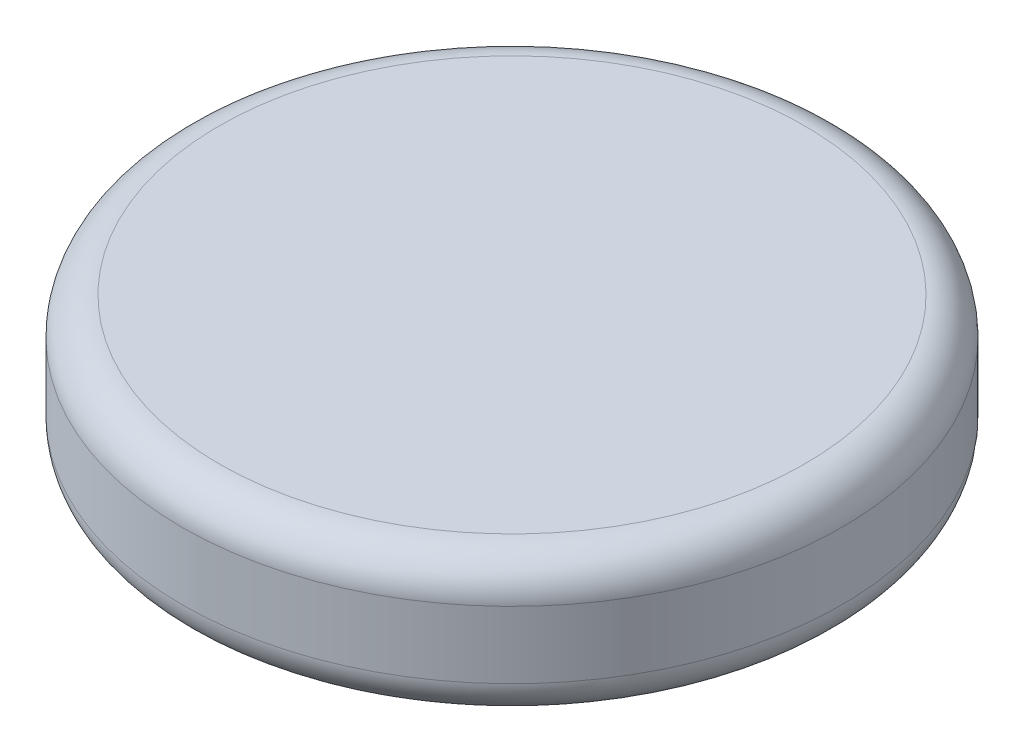
ISO-10303-21;
HEADER;
FILE_DESCRIPTION(('STEP AP214'),'2;1');
FILE_NAME('part.step','',(''),(''),'','','');
FILE_SCHEMA(('AUTOMOTIVE_DESIGN { 1 0 10303 214 1 1 1 1 }'));
ENDSEC;
DATA;
#1=APPLICATION_CONTEXT('core data for automotive mechanical design processes');
#2=APPLICATION_PROTOCOL_DEFINITION('international standard','automotive_design',2000,#1);
#3=PRODUCT_CONTEXT('',#1,'mechanical');
#4=PRODUCT('Part','Part','',(#3));
#5=PRODUCT_RELATED_PRODUCT_CATEGORY('part','',(#4));
#6=PRODUCT_DEFINITION_FORMATION('','',#4);
#7=PRODUCT_DEFINITION_CONTEXT('part definition',#1,'design');
#8=PRODUCT_DEFINITION('design','',#6,#7);
#9=PRODUCT_DEFINITION_SHAPE('','',#8);
#10=(LENGTH_UNIT() NAMED_UNIT(*) SI_UNIT(.MILLI.,.METRE.));
#11=(NAMED_UNIT(*) PLANE_ANGLE_UNIT() SI_UNIT($,.RADIAN.));
#12=(NAMED_UNIT(*) SI_UNIT($,.STERADIAN.) SOLID_ANGLE_UNIT());
#13=UNCERTAINTY_MEASURE_WITH_UNIT(LENGTH_MEASURE(1.E-05),#10,'distance_accuracy_value','');
#14=(GEOMETRIC_REPRESENTATION_CONTEXT(3) GLOBAL_UNCERTAINTY_ASSIGNED_CONTEXT((#13)) GLOBAL_UNIT_ASSIGNED_CONTEXT((#10,
#11,#12)) REPRESENTATION_CONTEXT('',''));
#15=CARTESIAN_POINT('',(0.,0.,0.));
#16=DIRECTION('',(0.,0.,1.));
#17=DIRECTION('',(1.,0.,0.));
#18=AXIS2_PLACEMENT_3D('',#15,#16,#17);
#19=CARTESIAN_POINT('',(0.,6.7945,0.));
#20=DIRECTION('',(0.,-1.,0.));
#21=DIRECTION('',(0.,0.,-1.));
#22=AXIS2_PLACEMENT_3D('',#19,#20,#21);
#23=CYLINDRICAL_SURFACE('',#22,15.9385);
#24=CARTESIAN_POINT('',(0.,1.778,0.));
#25=DIRECTION('',(0.,1.,0.));
#26=DIRECTION('',(0.,0.,1.));
#27=AXIS2_PLACEMENT_3D('',#24,#25,#26);
#28=CIRCLE('',#27,15.9385);
#29=CARTESIAN_POINT('',(0.,1.778,15.9385));
#30=VERTEX_POINT('',#29);
#31=EDGE_CURVE('E50',#30,#30,#28,.T.);
#32=ORIENTED_EDGE('',*,*,#31,.T.);
#33=EDGE_LOOP('',(#32));
#34=FACE_BOUND('',#33,.T.);
#35=CARTESIAN_POINT('',(0.,5.0165,0.));
#36=DIRECTION('',(0.,1.,0.));
#37=DIRECTION('',(0.,0.,1.));
#38=AXIS2_PLACEMENT_3D('',#35,#36,#37);
#39=CIRCLE('',#38,15.9385);
#40=CARTESIAN_POINT('',(0.,5.0165,15.9385));
#41=VERTEX_POINT('',#40);
#42=EDGE_CURVE('E54',#41,#41,#39,.F.);
#43=ORIENTED_EDGE('',*,*,#42,.T.);
#44=EDGE_LOOP('',(#43));
#45=FACE_BOUND('',#44,.T.);
#46=ADVANCED_FACE('F39',(#34,#45),#23,.T.);
#47=CARTESIAN_POINT('',(0.,6.7945,0.));
#48=DIRECTION('',(0.,1.,0.));
#49=DIRECTION('',(0.,0.,1.));
#50=AXIS2_PLACEMENT_3D('',#47,#48,#49);
#51=PLANE('',#50);
#52=CARTESIAN_POINT('',(0.,6.7945,0.));
#53=DIRECTION('',(0.,1.,0.));
#54=DIRECTION('',(0.,0.,1.));
#55=AXIS2_PLACEMENT_3D('',#52,#53,#54);
#56=CIRCLE('',#55,14.1605);
#57=CARTESIAN_POINT('',(0.,6.7945,14.1605));
#58=VERTEX_POINT('',#57);
#59=EDGE_CURVE('E10',#58,#58,#56,.T.);
#60=ORIENTED_EDGE('',*,*,#59,.T.);
#61=EDGE_LOOP('',(#60));
#62=FACE_BOUND('',#61,.T.);
#63=ADVANCED_FACE('F70',(#62),#51,.T.);
#64=CARTESIAN_POINT('',(0.,0.,0.));
#65=DIRECTION('',(0.,1.,0.));
#66=DIRECTION('',(0.,0.,1.));
#67=AXIS2_PLACEMENT_3D('',#64,#65,#66);
#68=PLANE('',#67);
#69=CARTESIAN_POINT('',(0.,0.,0.));
#70=DIRECTION('',(0.,1.,0.));
#71=DIRECTION('',(0.,0.,1.));
#72=AXIS2_PLACEMENT_3D('',#69,#70,#71);
#73=CIRCLE('',#72,14.1605);
#74=CARTESIAN_POINT('',(0.,0.,14.1605));
#75=VERTEX_POINT('',#74);
#76=EDGE_CURVE('E46',#75,#75,#73,.F.);
#77=ORIENTED_EDGE('',*,*,#76,.T.);
#78=EDGE_LOOP('',(#77));
#79=FACE_BOUND('',#78,.T.);
#80=ADVANCED_FACE('F67',(#79),#68,.F.);
#81=CARTESIAN_POINT('',(0.,1.778,0.));
#82=DIRECTION('',(0.,1.,0.));
#83=DIRECTION('',(0.,0.,1.));
#84=AXIS2_PLACEMENT_3D('',#81,#82,#83);
#85=TOROIDAL_SURFACE('',#84,14.1605,1.778);
#86=ORIENTED_EDGE('',*,*,#76,.F.);
#87=EDGE_LOOP('',(#86));
#88=FACE_BOUND('',#87,.T.);
#89=ORIENTED_EDGE('',*,*,#31,.F.);
#90=EDGE_LOOP('',(#89));
#91=FACE_BOUND('',#90,.T.);
#92=ADVANCED_FACE('F63',(#88,#91),#85,.T.);
#93=CARTESIAN_POINT('',(0.,5.0165,0.));
#94=DIRECTION('',(0.,1.,0.));
#95=DIRECTION('',(0.,0.,1.));
#96=AXIS2_PLACEMENT_3D('',#93,#94,#95);
#97=TOROIDAL_SURFACE('',#96,14.1605,1.778);
#98=ORIENTED_EDGE('',*,*,#42,.F.);
#99=EDGE_LOOP('',(#98));
#100=FACE_BOUND('',#99,.T.);
#101=ORIENTED_EDGE('',*,*,#59,.F.);
#102=EDGE_LOOP('',(#101));
#103=FACE_BOUND('',#102,.T.);
#104=ADVANCED_FACE('F41',(#100,#103),#97,.T.);
#105=CLOSED_SHELL('',(#46,#63,#80,#92,#104));
#106=MANIFOLD_SOLID_BREP('B2',#105);
#107=ADVANCED_BREP_SHAPE_REPRESENTATION('',(#18,#106),#14);
#108=SHAPE_DEFINITION_REPRESENTATION(#9,#107);
ENDSEC;
END-ISO-10303-21;
